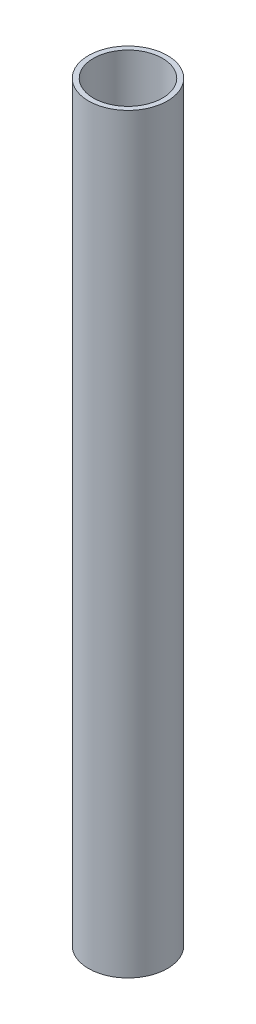
ISO-10303-21;
HEADER;
FILE_DESCRIPTION(('STEP AP214'),'2;1');
FILE_NAME('part.step','',(''),(''),'','','');
FILE_SCHEMA(('AUTOMOTIVE_DESIGN { 1 0 10303 214 1 1 1 1 }'));
ENDSEC;
DATA;
#1=APPLICATION_CONTEXT('core data for automotive mechanical design processes');
#2=APPLICATION_PROTOCOL_DEFINITION('international standard','automotive_design',2000,#1);
#3=PRODUCT_CONTEXT('',#1,'mechanical');
#4=PRODUCT('Part','Part','',(#3));
#5=PRODUCT_RELATED_PRODUCT_CATEGORY('part','',(#4));
#6=PRODUCT_DEFINITION_FORMATION('','',#4);
#7=PRODUCT_DEFINITION_CONTEXT('part definition',#1,'design');
#8=PRODUCT_DEFINITION('design','',#6,#7);
#9=PRODUCT_DEFINITION_SHAPE('','',#8);
#10=(LENGTH_UNIT() NAMED_UNIT(*) SI_UNIT(.MILLI.,.METRE.));
#11=(NAMED_UNIT(*) PLANE_ANGLE_UNIT() SI_UNIT($,.RADIAN.));
#12=(NAMED_UNIT(*) SI_UNIT($,.STERADIAN.) SOLID_ANGLE_UNIT());
#13=UNCERTAINTY_MEASURE_WITH_UNIT(LENGTH_MEASURE(1.E-05),#10,'distance_accuracy_value','');
#14=(GEOMETRIC_REPRESENTATION_CONTEXT(3) GLOBAL_UNCERTAINTY_ASSIGNED_CONTEXT((#13)) GLOBAL_UNIT_ASSIGNED_CONTEXT((#10,
#11,#12)) REPRESENTATION_CONTEXT('',''));
#15=CARTESIAN_POINT('',(0.,0.,0.));
#16=DIRECTION('',(0.,0.,1.));
#17=DIRECTION('',(1.,0.,0.));
#18=AXIS2_PLACEMENT_3D('',#15,#16,#17);
#19=CARTESIAN_POINT('',(0.,76.2,0.));
#20=DIRECTION('',(0.,1.,0.));
#21=DIRECTION('',(0.,0.,1.));
#22=AXIS2_PLACEMENT_3D('',#19,#20,#21);
#23=PLANE('',#22);
#24=CARTESIAN_POINT('',(0.,76.2,0.));
#25=DIRECTION('',(0.,1.,0.));
#26=DIRECTION('',(0.,0.,1.));
#27=AXIS2_PLACEMENT_3D('',#24,#25,#26);
#28=CIRCLE('',#27,4.);
#29=CARTESIAN_POINT('',(0.,76.2,4.));
#30=VERTEX_POINT('',#29);
#31=EDGE_CURVE('E10',#30,#30,#28,.T.);
#32=ORIENTED_EDGE('',*,*,#31,.T.);
#33=EDGE_LOOP('',(#32));
#34=FACE_BOUND('',#33,.T.);
#35=CARTESIAN_POINT('',(0.,76.2,0.));
#36=DIRECTION('',(0.,1.,0.));
#37=DIRECTION('',(0.,0.,1.));
#38=AXIS2_PLACEMENT_3D('',#35,#36,#37);
#39=CIRCLE('',#38,3.5);
#40=CARTESIAN_POINT('',(0.,76.2,3.5));
#41=VERTEX_POINT('',#40);
#42=EDGE_CURVE('E46',#41,#41,#39,.T.);
#43=ORIENTED_EDGE('',*,*,#42,.F.);
#44=EDGE_LOOP('',(#43));
#45=FACE_BOUND('',#44,.T.);
#46=ADVANCED_FACE('F32',(#34,#45),#23,.T.);
#47=CARTESIAN_POINT('',(0.,0.,0.));
#48=DIRECTION('',(0.,1.,0.));
#49=DIRECTION('',(0.,0.,1.));
#50=AXIS2_PLACEMENT_3D('',#47,#48,#49);
#51=PLANE('',#50);
#52=CARTESIAN_POINT('',(0.,0.,0.));
#53=DIRECTION('',(0.,1.,0.));
#54=DIRECTION('',(0.,0.,1.));
#55=AXIS2_PLACEMENT_3D('',#52,#53,#54);
#56=CIRCLE('',#55,4.);
#57=CARTESIAN_POINT('',(0.,0.,4.));
#58=VERTEX_POINT('',#57);
#59=EDGE_CURVE('E36',#58,#58,#56,.T.);
#60=ORIENTED_EDGE('',*,*,#59,.F.);
#61=EDGE_LOOP('',(#60));
#62=FACE_BOUND('',#61,.T.);
#63=CARTESIAN_POINT('',(0.,0.,0.));
#64=DIRECTION('',(0.,1.,0.));
#65=DIRECTION('',(0.,0.,1.));
#66=AXIS2_PLACEMENT_3D('',#63,#64,#65);
#67=CIRCLE('',#66,3.5);
#68=CARTESIAN_POINT('',(0.,0.,3.5));
#69=VERTEX_POINT('',#68);
#70=EDGE_CURVE('E48',#69,#69,#67,.T.);
#71=ORIENTED_EDGE('',*,*,#70,.T.);
#72=EDGE_LOOP('',(#71));
#73=FACE_BOUND('',#72,.T.);
#74=ADVANCED_FACE('F59',(#62,#73),#51,.F.);
#75=CARTESIAN_POINT('',(0.,76.2,0.));
#76=DIRECTION('',(0.,-1.,0.));
#77=DIRECTION('',(0.,0.,-1.));
#78=AXIS2_PLACEMENT_3D('',#75,#76,#77);
#79=CYLINDRICAL_SURFACE('',#78,4.);
#80=ORIENTED_EDGE('',*,*,#31,.F.);
#81=EDGE_LOOP('',(#80));
#82=FACE_BOUND('',#81,.T.);
#83=ORIENTED_EDGE('',*,*,#59,.T.);
#84=EDGE_LOOP('',(#83));
#85=FACE_BOUND('',#84,.T.);
#86=ADVANCED_FACE('F34',(#82,#85),#79,.T.);
#87=CARTESIAN_POINT('',(0.,76.2,0.));
#88=DIRECTION('',(0.,-1.,0.));
#89=DIRECTION('',(0.,0.,-1.));
#90=AXIS2_PLACEMENT_3D('',#87,#88,#89);
#91=CYLINDRICAL_SURFACE('',#90,3.5);
#92=ORIENTED_EDGE('',*,*,#42,.T.);
#93=EDGE_LOOP('',(#92));
#94=FACE_BOUND('',#93,.T.);
#95=ORIENTED_EDGE('',*,*,#70,.F.);
#96=EDGE_LOOP('',(#95));
#97=FACE_BOUND('',#96,.T.);
#98=ADVANCED_FACE('F55',(#94,#97),#91,.F.);
#99=CLOSED_SHELL('',(#46,#74,#86,#98));
#100=MANIFOLD_SOLID_BREP('B2',#99);
#101=ADVANCED_BREP_SHAPE_REPRESENTATION('',(#18,#100),#14);
#102=SHAPE_DEFINITION_REPRESENTATION(#9,#101);
ENDSEC;
END-ISO-10303-21;
